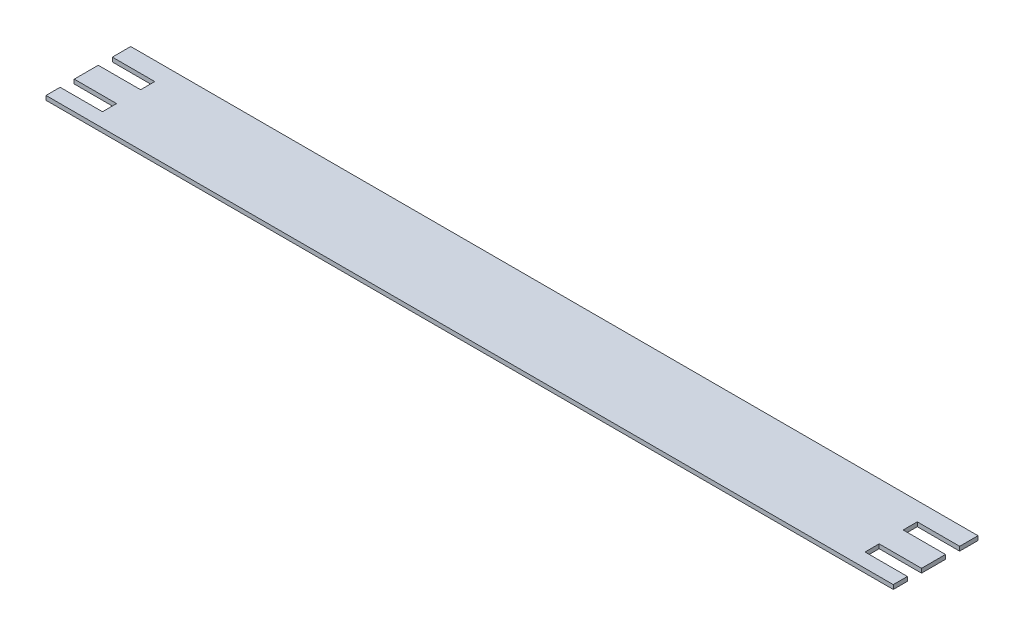
ISO-10303-21;
HEADER;
FILE_DESCRIPTION(('STEP AP214'),'2;1');
FILE_NAME('part.step','',(''),(''),'','','');
FILE_SCHEMA(('AUTOMOTIVE_DESIGN { 1 0 10303 214 1 1 1 1 }'));
ENDSEC;
DATA;
#1=APPLICATION_CONTEXT('core data for automotive mechanical design processes');
#2=APPLICATION_PROTOCOL_DEFINITION('international standard','automotive_design',2000,#1);
#3=PRODUCT_CONTEXT('',#1,'mechanical');
#4=PRODUCT('Part','Part','',(#3));
#5=PRODUCT_RELATED_PRODUCT_CATEGORY('part','',(#4));
#6=PRODUCT_DEFINITION_FORMATION('','',#4);
#7=PRODUCT_DEFINITION_CONTEXT('part definition',#1,'design');
#8=PRODUCT_DEFINITION('design','',#6,#7);
#9=PRODUCT_DEFINITION_SHAPE('','',#8);
#10=(LENGTH_UNIT() NAMED_UNIT(*) SI_UNIT(.MILLI.,.METRE.));
#11=(NAMED_UNIT(*) PLANE_ANGLE_UNIT() SI_UNIT($,.RADIAN.));
#12=(NAMED_UNIT(*) SI_UNIT($,.STERADIAN.) SOLID_ANGLE_UNIT());
#13=UNCERTAINTY_MEASURE_WITH_UNIT(LENGTH_MEASURE(1.E-05),#10,'distance_accuracy_value','');
#14=(GEOMETRIC_REPRESENTATION_CONTEXT(3) GLOBAL_UNCERTAINTY_ASSIGNED_CONTEXT((#13)) GLOBAL_UNIT_ASSIGNED_CONTEXT((#10,
#11,#12)) REPRESENTATION_CONTEXT('',''));
#15=CARTESIAN_POINT('',(0.,0.,0.));
#16=DIRECTION('',(0.,0.,1.));
#17=DIRECTION('',(1.,0.,0.));
#18=AXIS2_PLACEMENT_3D('',#15,#16,#17);
#19=CARTESIAN_POINT('',(300.,-50.01,13.));
#20=DIRECTION('',(0.,0.,-1.));
#21=DIRECTION('',(-1.,0.,0.));
#22=AXIS2_PLACEMENT_3D('',#19,#20,#21);
#23=PLANE('',#22);
#24=DIRECTION('',(0.,-1.,0.));
#25=VECTOR('',#24,1.);
#26=CARTESIAN_POINT('',(300.,1.71683972880179E-13,13.));
#27=LINE('',#26,#25);
#28=CARTESIAN_POINT('',(300.,-47.,13.));
#29=VERTEX_POINT('',#28);
#30=CARTESIAN_POINT('',(300.,-50.,13.));
#31=VERTEX_POINT('',#30);
#32=EDGE_CURVE('E228',#29,#31,#27,.T.);
#33=ORIENTED_EDGE('',*,*,#32,.F.);
#34=DIRECTION('',(1.,0.,0.));
#35=VECTOR('',#34,1.);
#36=CARTESIAN_POINT('',(-300.,-47.,13.));
#37=LINE('',#36,#35);
#38=CARTESIAN_POINT('',(270.,-47.,13.));
#39=VERTEX_POINT('',#38);
#40=EDGE_CURVE('E237',#39,#29,#37,.T.);
#41=ORIENTED_EDGE('',*,*,#40,.F.);
#42=DIRECTION('',(0.,1.,0.));
#43=VECTOR('',#42,1.);
#44=CARTESIAN_POINT('',(270.,-50.01,13.));
#45=LINE('',#44,#43);
#46=CARTESIAN_POINT('',(270.,-50.,13.));
#47=VERTEX_POINT('',#46);
#48=EDGE_CURVE('E300',#47,#39,#45,.T.);
#49=ORIENTED_EDGE('',*,*,#48,.F.);
#50=DIRECTION('',(-1.,0.,0.));
#51=VECTOR('',#50,1.);
#52=CARTESIAN_POINT('',(-300.,-50.,13.));
#53=LINE('',#52,#51);
#54=EDGE_CURVE('E265',#31,#47,#53,.T.);
#55=ORIENTED_EDGE('',*,*,#54,.F.);
#56=EDGE_LOOP('',(#33,#41,#49,#55));
#57=FACE_BOUND('',#56,.T.);
#58=ADVANCED_FACE('F32',(#57),#23,.F.);
#59=CARTESIAN_POINT('',(300.,-50.01,23.));
#60=DIRECTION('',(0.,0.,1.));
#61=DIRECTION('',(1.,0.,0.));
#62=AXIS2_PLACEMENT_3D('',#59,#60,#61);
#63=PLANE('',#62);
#64=DIRECTION('',(0.,1.,0.));
#65=VECTOR('',#64,1.);
#66=CARTESIAN_POINT('',(270.,-50.01,23.));
#67=LINE('',#66,#65);
#68=CARTESIAN_POINT('',(270.,-50.,23.));
#69=VERTEX_POINT('',#68);
#70=CARTESIAN_POINT('',(270.,-47.,23.));
#71=VERTEX_POINT('',#70);
#72=EDGE_CURVE('E36',#69,#71,#67,.T.);
#73=ORIENTED_EDGE('',*,*,#72,.T.);
#74=DIRECTION('',(-1.,0.,0.));
#75=VECTOR('',#74,1.);
#76=CARTESIAN_POINT('',(-300.,-47.,23.));
#77=LINE('',#76,#75);
#78=CARTESIAN_POINT('',(300.,-47.,23.));
#79=VERTEX_POINT('',#78);
#80=EDGE_CURVE('E277',#79,#71,#77,.T.);
#81=ORIENTED_EDGE('',*,*,#80,.F.);
#82=DIRECTION('',(0.,1.,0.));
#83=VECTOR('',#82,1.);
#84=CARTESIAN_POINT('',(300.,1.71683972880179E-13,23.));
#85=LINE('',#84,#83);
#86=CARTESIAN_POINT('',(300.,-50.,23.));
#87=VERTEX_POINT('',#86);
#88=EDGE_CURVE('E225',#87,#79,#85,.T.);
#89=ORIENTED_EDGE('',*,*,#88,.F.);
#90=DIRECTION('',(1.,0.,0.));
#91=VECTOR('',#90,1.);
#92=CARTESIAN_POINT('',(-300.,-50.,23.));
#93=LINE('',#92,#91);
#94=EDGE_CURVE('E269',#69,#87,#93,.T.);
#95=ORIENTED_EDGE('',*,*,#94,.F.);
#96=EDGE_LOOP('',(#73,#81,#89,#95));
#97=FACE_BOUND('',#96,.T.);
#98=ADVANCED_FACE('F313',(#97),#63,.F.);
#99=CARTESIAN_POINT('',(270.,-50.01,13.));
#100=DIRECTION('',(-1.,0.,0.));
#101=DIRECTION('',(0.,0.,1.));
#102=AXIS2_PLACEMENT_3D('',#99,#100,#101);
#103=PLANE('',#102);
#104=ORIENTED_EDGE('',*,*,#48,.T.);
#105=DIRECTION('',(0.,0.,-1.));
#106=VECTOR('',#105,1.);
#107=CARTESIAN_POINT('',(270.,-47.,3.));
#108=LINE('',#107,#106);
#109=EDGE_CURVE('E317',#71,#39,#108,.T.);
#110=ORIENTED_EDGE('',*,*,#109,.F.);
#111=ORIENTED_EDGE('',*,*,#72,.F.);
#112=DIRECTION('',(0.,0.,1.));
#113=VECTOR('',#112,1.);
#114=CARTESIAN_POINT('',(270.,-50.,60.));
#115=LINE('',#114,#113);
#116=EDGE_CURVE('E342',#47,#69,#115,.T.);
#117=ORIENTED_EDGE('',*,*,#116,.F.);
#118=EDGE_LOOP('',(#104,#110,#111,#117));
#119=FACE_BOUND('',#118,.T.);
#120=ADVANCED_FACE('F318',(#119),#103,.F.);
#121=CARTESIAN_POINT('',(300.,-50.01,40.));
#122=DIRECTION('',(0.,0.,-1.));
#123=DIRECTION('',(-1.,0.,0.));
#124=AXIS2_PLACEMENT_3D('',#121,#122,#123);
#125=PLANE('',#124);
#126=DIRECTION('',(0.,-1.,0.));
#127=VECTOR('',#126,1.);
#128=CARTESIAN_POINT('',(300.,1.71683972880179E-13,40.));
#129=LINE('',#128,#127);
#130=CARTESIAN_POINT('',(300.,-47.,40.));
#131=VERTEX_POINT('',#130);
#132=CARTESIAN_POINT('',(300.,-50.,40.));
#133=VERTEX_POINT('',#132);
#134=EDGE_CURVE('E222',#131,#133,#129,.T.);
#135=ORIENTED_EDGE('',*,*,#134,.F.);
#136=DIRECTION('',(1.,0.,0.));
#137=VECTOR('',#136,1.);
#138=CARTESIAN_POINT('',(-300.,-47.,40.));
#139=LINE('',#138,#137);
#140=CARTESIAN_POINT('',(270.,-47.,40.));
#141=VERTEX_POINT('',#140);
#142=EDGE_CURVE('E232',#141,#131,#139,.T.);
#143=ORIENTED_EDGE('',*,*,#142,.F.);
#144=DIRECTION('',(0.,1.,0.));
#145=VECTOR('',#144,1.);
#146=CARTESIAN_POINT('',(270.,-50.01,40.));
#147=LINE('',#146,#145);
#148=CARTESIAN_POINT('',(270.,-50.,40.));
#149=VERTEX_POINT('',#148);
#150=EDGE_CURVE('E251',#149,#141,#147,.T.);
#151=ORIENTED_EDGE('',*,*,#150,.F.);
#152=DIRECTION('',(-1.,0.,0.));
#153=VECTOR('',#152,1.);
#154=CARTESIAN_POINT('',(-300.,-50.,40.));
#155=LINE('',#154,#153);
#156=EDGE_CURVE('E241',#133,#149,#155,.T.);
#157=ORIENTED_EDGE('',*,*,#156,.F.);
#158=EDGE_LOOP('',(#135,#143,#151,#157));
#159=FACE_BOUND('',#158,.T.);
#160=ADVANCED_FACE('F374',(#159),#125,.F.);
#161=CARTESIAN_POINT('',(300.,-50.01,50.));
#162=DIRECTION('',(0.,0.,1.));
#163=DIRECTION('',(1.,0.,0.));
#164=AXIS2_PLACEMENT_3D('',#161,#162,#163);
#165=PLANE('',#164);
#166=DIRECTION('',(0.,1.,0.));
#167=VECTOR('',#166,1.);
#168=CARTESIAN_POINT('',(270.,-50.01,50.));
#169=LINE('',#168,#167);
#170=CARTESIAN_POINT('',(270.,-50.,50.));
#171=VERTEX_POINT('',#170);
#172=CARTESIAN_POINT('',(270.,-47.,50.));
#173=VERTEX_POINT('',#172);
#174=EDGE_CURVE('E255',#171,#173,#169,.T.);
#175=ORIENTED_EDGE('',*,*,#174,.T.);
#176=DIRECTION('',(-1.,0.,0.));
#177=VECTOR('',#176,1.);
#178=CARTESIAN_POINT('',(-300.,-47.,50.));
#179=LINE('',#178,#177);
#180=CARTESIAN_POINT('',(300.,-47.,50.));
#181=VERTEX_POINT('',#180);
#182=EDGE_CURVE('E226',#181,#173,#179,.T.);
#183=ORIENTED_EDGE('',*,*,#182,.F.);
#184=DIRECTION('',(0.,1.,0.));
#185=VECTOR('',#184,1.);
#186=CARTESIAN_POINT('',(300.,1.71683972880179E-13,50.));
#187=LINE('',#186,#185);
#188=CARTESIAN_POINT('',(300.,-50.,50.));
#189=VERTEX_POINT('',#188);
#190=EDGE_CURVE('E220',#189,#181,#187,.T.);
#191=ORIENTED_EDGE('',*,*,#190,.F.);
#192=DIRECTION('',(1.,0.,0.));
#193=VECTOR('',#192,1.);
#194=CARTESIAN_POINT('',(-300.,-50.,50.));
#195=LINE('',#194,#193);
#196=EDGE_CURVE('E235',#171,#189,#195,.T.);
#197=ORIENTED_EDGE('',*,*,#196,.F.);
#198=EDGE_LOOP('',(#175,#183,#191,#197));
#199=FACE_BOUND('',#198,.T.);
#200=ADVANCED_FACE('F378',(#199),#165,.F.);
#201=CARTESIAN_POINT('',(270.,-50.01,40.));
#202=DIRECTION('',(-1.,0.,0.));
#203=DIRECTION('',(0.,0.,1.));
#204=AXIS2_PLACEMENT_3D('',#201,#202,#203);
#205=PLANE('',#204);
#206=ORIENTED_EDGE('',*,*,#150,.T.);
#207=DIRECTION('',(0.,0.,-1.));
#208=VECTOR('',#207,1.);
#209=CARTESIAN_POINT('',(270.,-47.,3.));
#210=LINE('',#209,#208);
#211=EDGE_CURVE('E229',#173,#141,#210,.T.);
#212=ORIENTED_EDGE('',*,*,#211,.F.);
#213=ORIENTED_EDGE('',*,*,#174,.F.);
#214=DIRECTION('',(0.,0.,1.));
#215=VECTOR('',#214,1.);
#216=CARTESIAN_POINT('',(270.,-50.,60.));
#217=LINE('',#216,#215);
#218=EDGE_CURVE('E238',#149,#171,#217,.T.);
#219=ORIENTED_EDGE('',*,*,#218,.F.);
#220=EDGE_LOOP('',(#206,#212,#213,#219));
#221=FACE_BOUND('',#220,.T.);
#222=ADVANCED_FACE('F384',(#221),#205,.F.);
#223=CARTESIAN_POINT('',(-300.,-50.01,23.));
#224=DIRECTION('',(0.,0.,1.));
#225=DIRECTION('',(1.,0.,0.));
#226=AXIS2_PLACEMENT_3D('',#223,#224,#225);
#227=PLANE('',#226);
#228=DIRECTION('',(0.,1.,0.));
#229=VECTOR('',#228,1.);
#230=CARTESIAN_POINT('',(-300.,0.,23.));
#231=LINE('',#230,#229);
#232=CARTESIAN_POINT('',(-300.,-50.,23.));
#233=VERTEX_POINT('',#232);
#234=CARTESIAN_POINT('',(-300.,-47.,23.));
#235=VERTEX_POINT('',#234);
#236=EDGE_CURVE('E181',#233,#235,#231,.T.);
#237=ORIENTED_EDGE('',*,*,#236,.T.);
#238=DIRECTION('',(-1.,0.,0.));
#239=VECTOR('',#238,1.);
#240=CARTESIAN_POINT('',(-300.,-47.,23.));
#241=LINE('',#240,#239);
#242=CARTESIAN_POINT('',(-270.,-47.,23.));
#243=VERTEX_POINT('',#242);
#244=EDGE_CURVE('E275',#243,#235,#241,.T.);
#245=ORIENTED_EDGE('',*,*,#244,.F.);
#246=DIRECTION('',(0.,1.,0.));
#247=VECTOR('',#246,1.);
#248=CARTESIAN_POINT('',(-270.,-50.01,23.));
#249=LINE('',#248,#247);
#250=CARTESIAN_POINT('',(-270.,-50.,23.));
#251=VERTEX_POINT('',#250);
#252=EDGE_CURVE('E259',#251,#243,#249,.T.);
#253=ORIENTED_EDGE('',*,*,#252,.F.);
#254=DIRECTION('',(1.,0.,0.));
#255=VECTOR('',#254,1.);
#256=CARTESIAN_POINT('',(-300.,-50.,23.));
#257=LINE('',#256,#255);
#258=EDGE_CURVE('E266',#233,#251,#257,.T.);
#259=ORIENTED_EDGE('',*,*,#258,.F.);
#260=EDGE_LOOP('',(#237,#245,#253,#259));
#261=FACE_BOUND('',#260,.T.);
#262=ADVANCED_FACE('F390',(#261),#227,.F.);
#263=CARTESIAN_POINT('',(-300.,-50.01,13.));
#264=DIRECTION('',(0.,0.,-1.));
#265=DIRECTION('',(-1.,0.,0.));
#266=AXIS2_PLACEMENT_3D('',#263,#264,#265);
#267=PLANE('',#266);
#268=DIRECTION('',(0.,1.,0.));
#269=VECTOR('',#268,1.);
#270=CARTESIAN_POINT('',(-270.,-50.01,13.));
#271=LINE('',#270,#269);
#272=CARTESIAN_POINT('',(-270.,-50.,13.));
#273=VERTEX_POINT('',#272);
#274=CARTESIAN_POINT('',(-270.,-47.,13.));
#275=VERTEX_POINT('',#274);
#276=EDGE_CURVE('E188',#273,#275,#271,.T.);
#277=ORIENTED_EDGE('',*,*,#276,.T.);
#278=DIRECTION('',(1.,0.,0.));
#279=VECTOR('',#278,1.);
#280=CARTESIAN_POINT('',(-300.,-47.,13.));
#281=LINE('',#280,#279);
#282=CARTESIAN_POINT('',(-300.,-47.,13.));
#283=VERTEX_POINT('',#282);
#284=EDGE_CURVE('E185',#283,#275,#281,.T.);
#285=ORIENTED_EDGE('',*,*,#284,.F.);
#286=DIRECTION('',(0.,-1.,0.));
#287=VECTOR('',#286,1.);
#288=CARTESIAN_POINT('',(-300.,0.,13.));
#289=LINE('',#288,#287);
#290=CARTESIAN_POINT('',(-300.,-50.,13.));
#291=VERTEX_POINT('',#290);
#292=EDGE_CURVE('E173',#283,#291,#289,.T.);
#293=ORIENTED_EDGE('',*,*,#292,.T.);
#294=DIRECTION('',(-1.,0.,0.));
#295=VECTOR('',#294,1.);
#296=CARTESIAN_POINT('',(-300.,-50.,13.));
#297=LINE('',#296,#295);
#298=EDGE_CURVE('E272',#273,#291,#297,.T.);
#299=ORIENTED_EDGE('',*,*,#298,.F.);
#300=EDGE_LOOP('',(#277,#285,#293,#299));
#301=FACE_BOUND('',#300,.T.);
#302=ADVANCED_FACE('F186',(#301),#267,.F.);
#303=CARTESIAN_POINT('',(-270.,-50.01,13.));
#304=DIRECTION('',(1.,0.,0.));
#305=DIRECTION('',(0.,0.,-1.));
#306=AXIS2_PLACEMENT_3D('',#303,#304,#305);
#307=PLANE('',#306);
#308=ORIENTED_EDGE('',*,*,#252,.T.);
#309=DIRECTION('',(0.,0.,1.));
#310=VECTOR('',#309,1.);
#311=CARTESIAN_POINT('',(-270.,-47.,3.));
#312=LINE('',#311,#310);
#313=EDGE_CURVE('E192',#275,#243,#312,.T.);
#314=ORIENTED_EDGE('',*,*,#313,.F.);
#315=ORIENTED_EDGE('',*,*,#276,.F.);
#316=DIRECTION('',(0.,0.,-1.));
#317=VECTOR('',#316,1.);
#318=CARTESIAN_POINT('',(-270.,-50.,60.));
#319=LINE('',#318,#317);
#320=EDGE_CURVE('E268',#251,#273,#319,.T.);
#321=ORIENTED_EDGE('',*,*,#320,.F.);
#322=EDGE_LOOP('',(#308,#314,#315,#321));
#323=FACE_BOUND('',#322,.T.);
#324=ADVANCED_FACE('F400',(#323),#307,.F.);
#325=CARTESIAN_POINT('',(-300.,-50.01,50.));
#326=DIRECTION('',(0.,0.,1.));
#327=DIRECTION('',(1.,0.,0.));
#328=AXIS2_PLACEMENT_3D('',#325,#326,#327);
#329=PLANE('',#328);
#330=DIRECTION('',(0.,1.,0.));
#331=VECTOR('',#330,1.);
#332=CARTESIAN_POINT('',(-300.,0.,50.));
#333=LINE('',#332,#331);
#334=CARTESIAN_POINT('',(-300.,-50.,50.));
#335=VERTEX_POINT('',#334);
#336=CARTESIAN_POINT('',(-300.,-47.,50.));
#337=VERTEX_POINT('',#336);
#338=EDGE_CURVE('E182',#335,#337,#333,.T.);
#339=ORIENTED_EDGE('',*,*,#338,.T.);
#340=DIRECTION('',(-1.,0.,0.));
#341=VECTOR('',#340,1.);
#342=CARTESIAN_POINT('',(-300.,-47.,50.));
#343=LINE('',#342,#341);
#344=CARTESIAN_POINT('',(-270.,-47.,50.));
#345=VERTEX_POINT('',#344);
#346=EDGE_CURVE('E191',#345,#337,#343,.T.);
#347=ORIENTED_EDGE('',*,*,#346,.F.);
#348=DIRECTION('',(0.,1.,0.));
#349=VECTOR('',#348,1.);
#350=CARTESIAN_POINT('',(-270.,-50.01,50.));
#351=LINE('',#350,#349);
#352=CARTESIAN_POINT('',(-270.,-50.,50.));
#353=VERTEX_POINT('',#352);
#354=EDGE_CURVE('E260',#353,#345,#351,.T.);
#355=ORIENTED_EDGE('',*,*,#354,.F.);
#356=DIRECTION('',(1.,0.,0.));
#357=VECTOR('',#356,1.);
#358=CARTESIAN_POINT('',(-300.,-50.,50.));
#359=LINE('',#358,#357);
#360=EDGE_CURVE('E274',#335,#353,#359,.T.);
#361=ORIENTED_EDGE('',*,*,#360,.F.);
#362=EDGE_LOOP('',(#339,#347,#355,#361));
#363=FACE_BOUND('',#362,.T.);
#364=ADVANCED_FACE('F293',(#363),#329,.F.);
#365=CARTESIAN_POINT('',(-300.,-50.01,40.));
#366=DIRECTION('',(0.,0.,-1.));
#367=DIRECTION('',(-1.,0.,0.));
#368=AXIS2_PLACEMENT_3D('',#365,#366,#367);
#369=PLANE('',#368);
#370=DIRECTION('',(0.,1.,0.));
#371=VECTOR('',#370,1.);
#372=CARTESIAN_POINT('',(-270.,-50.01,40.));
#373=LINE('',#372,#371);
#374=CARTESIAN_POINT('',(-270.,-50.,40.));
#375=VERTEX_POINT('',#374);
#376=CARTESIAN_POINT('',(-270.,-47.,40.));
#377=VERTEX_POINT('',#376);
#378=EDGE_CURVE('E254',#375,#377,#373,.T.);
#379=ORIENTED_EDGE('',*,*,#378,.T.);
#380=DIRECTION('',(1.,0.,0.));
#381=VECTOR('',#380,1.);
#382=CARTESIAN_POINT('',(-300.,-47.,40.));
#383=LINE('',#382,#381);
#384=CARTESIAN_POINT('',(-300.,-47.,40.));
#385=VERTEX_POINT('',#384);
#386=EDGE_CURVE('E234',#385,#377,#383,.T.);
#387=ORIENTED_EDGE('',*,*,#386,.F.);
#388=DIRECTION('',(0.,-1.,0.));
#389=VECTOR('',#388,1.);
#390=CARTESIAN_POINT('',(-300.,0.,40.));
#391=LINE('',#390,#389);
#392=CARTESIAN_POINT('',(-300.,-50.,40.));
#393=VERTEX_POINT('',#392);
#394=EDGE_CURVE('E302',#385,#393,#391,.T.);
#395=ORIENTED_EDGE('',*,*,#394,.T.);
#396=DIRECTION('',(-1.,0.,0.));
#397=VECTOR('',#396,1.);
#398=CARTESIAN_POINT('',(-300.,-50.,40.));
#399=LINE('',#398,#397);
#400=EDGE_CURVE('E243',#375,#393,#399,.T.);
#401=ORIENTED_EDGE('',*,*,#400,.F.);
#402=EDGE_LOOP('',(#379,#387,#395,#401));
#403=FACE_BOUND('',#402,.T.);
#404=ADVANCED_FACE('F406',(#403),#369,.F.);
#405=CARTESIAN_POINT('',(-270.,-50.01,40.));
#406=DIRECTION('',(1.,0.,0.));
#407=DIRECTION('',(0.,0.,-1.));
#408=AXIS2_PLACEMENT_3D('',#405,#406,#407);
#409=PLANE('',#408);
#410=ORIENTED_EDGE('',*,*,#354,.T.);
#411=DIRECTION('',(0.,0.,1.));
#412=VECTOR('',#411,1.);
#413=CARTESIAN_POINT('',(-270.,-47.,3.));
#414=LINE('',#413,#412);
#415=EDGE_CURVE('E288',#377,#345,#414,.T.);
#416=ORIENTED_EDGE('',*,*,#415,.F.);
#417=ORIENTED_EDGE('',*,*,#378,.F.);
#418=DIRECTION('',(0.,0.,-1.));
#419=VECTOR('',#418,1.);
#420=CARTESIAN_POINT('',(-270.,-50.,60.));
#421=LINE('',#420,#419);
#422=EDGE_CURVE('E290',#353,#375,#421,.T.);
#423=ORIENTED_EDGE('',*,*,#422,.F.);
#424=EDGE_LOOP('',(#410,#416,#417,#423));
#425=FACE_BOUND('',#424,.T.);
#426=ADVANCED_FACE('F285',(#425),#409,.F.);
#427=CARTESIAN_POINT('',(-300.,0.,0.));
#428=DIRECTION('',(0.,0.,1.));
#429=DIRECTION('',(1.,0.,0.));
#430=AXIS2_PLACEMENT_3D('',#427,#428,#429);
#431=PLANE('',#430);
#432=DIRECTION('',(0.,-1.,0.));
#433=VECTOR('',#432,1.);
#434=CARTESIAN_POINT('',(-300.,0.,0.));
#435=LINE('',#434,#433);
#436=CARTESIAN_POINT('',(-300.,-47.,0.));
#437=VERTEX_POINT('',#436);
#438=CARTESIAN_POINT('',(-300.,-50.,0.));
#439=VERTEX_POINT('',#438);
#440=EDGE_CURVE('E11',#437,#439,#435,.T.);
#441=ORIENTED_EDGE('',*,*,#440,.F.);
#442=DIRECTION('',(-1.,0.,0.));
#443=VECTOR('',#442,1.);
#444=CARTESIAN_POINT('',(-300.,-47.,0.));
#445=LINE('',#444,#443);
#446=CARTESIAN_POINT('',(300.,-47.,0.));
#447=VERTEX_POINT('',#446);
#448=EDGE_CURVE('E196',#447,#437,#445,.T.);
#449=ORIENTED_EDGE('',*,*,#448,.F.);
#450=DIRECTION('',(0.,-1.,0.));
#451=VECTOR('',#450,1.);
#452=CARTESIAN_POINT('',(300.,3.43367945760358E-13,0.));
#453=LINE('',#452,#451);
#454=CARTESIAN_POINT('',(300.,-50.,0.));
#455=VERTEX_POINT('',#454);
#456=EDGE_CURVE('E41',#447,#455,#453,.T.);
#457=ORIENTED_EDGE('',*,*,#456,.T.);
#458=DIRECTION('',(1.,0.,0.));
#459=VECTOR('',#458,1.);
#460=CARTESIAN_POINT('',(-300.,-50.,0.));
#461=LINE('',#460,#459);
#462=EDGE_CURVE('E210',#439,#455,#461,.T.);
#463=ORIENTED_EDGE('',*,*,#462,.F.);
#464=EDGE_LOOP('',(#441,#449,#457,#463));
#465=FACE_BOUND('',#464,.T.);
#466=ADVANCED_FACE('F350',(#465),#431,.F.);
#467=CARTESIAN_POINT('',(-300.,0.,60.));
#468=DIRECTION('',(0.,0.,1.));
#469=DIRECTION('',(1.,0.,0.));
#470=AXIS2_PLACEMENT_3D('',#467,#468,#469);
#471=PLANE('',#470);
#472=DIRECTION('',(1.,0.,0.));
#473=VECTOR('',#472,1.);
#474=CARTESIAN_POINT('',(-300.,-47.,60.));
#475=LINE('',#474,#473);
#476=CARTESIAN_POINT('',(-300.,-47.,60.));
#477=VERTEX_POINT('',#476);
#478=CARTESIAN_POINT('',(300.,-47.,60.));
#479=VERTEX_POINT('',#478);
#480=EDGE_CURVE('E206',#477,#479,#475,.T.);
#481=ORIENTED_EDGE('',*,*,#480,.F.);
#482=DIRECTION('',(0.,-1.,0.));
#483=VECTOR('',#482,1.);
#484=CARTESIAN_POINT('',(-300.,0.,60.));
#485=LINE('',#484,#483);
#486=CARTESIAN_POINT('',(-300.,-50.,60.));
#487=VERTEX_POINT('',#486);
#488=EDGE_CURVE('E326',#477,#487,#485,.T.);
#489=ORIENTED_EDGE('',*,*,#488,.T.);
#490=DIRECTION('',(1.,0.,0.));
#491=VECTOR('',#490,1.);
#492=CARTESIAN_POINT('',(-300.,-50.,60.));
#493=LINE('',#492,#491);
#494=CARTESIAN_POINT('',(300.,-50.,60.));
#495=VERTEX_POINT('',#494);
#496=EDGE_CURVE('E198',#487,#495,#493,.T.);
#497=ORIENTED_EDGE('',*,*,#496,.T.);
#498=DIRECTION('',(0.,-1.,0.));
#499=VECTOR('',#498,1.);
#500=CARTESIAN_POINT('',(300.,3.43367945760358E-13,60.));
#501=LINE('',#500,#499);
#502=EDGE_CURVE('E329',#479,#495,#501,.T.);
#503=ORIENTED_EDGE('',*,*,#502,.F.);
#504=EDGE_LOOP('',(#481,#489,#497,#503));
#505=FACE_BOUND('',#504,.T.);
#506=ADVANCED_FACE('F358',(#505),#471,.T.);
#507=CARTESIAN_POINT('',(-300.,-47.,3.));
#508=DIRECTION('',(0.,-1.,0.));
#509=DIRECTION('',(0.,0.,-1.));
#510=AXIS2_PLACEMENT_3D('',#507,#508,#509);
#511=PLANE('',#510);
#512=ORIENTED_EDGE('',*,*,#109,.T.);
#513=ORIENTED_EDGE('',*,*,#40,.T.);
#514=DIRECTION('',(0.,0.,1.));
#515=VECTOR('',#514,1.);
#516=CARTESIAN_POINT('',(300.,-47.,3.));
#517=LINE('',#516,#515);
#518=EDGE_CURVE('E57',#447,#29,#517,.T.);
#519=ORIENTED_EDGE('',*,*,#518,.F.);
#520=ORIENTED_EDGE('',*,*,#448,.T.);
#521=DIRECTION('',(0.,0.,1.));
#522=VECTOR('',#521,1.);
#523=CARTESIAN_POINT('',(-300.,-47.,3.));
#524=LINE('',#523,#522);
#525=EDGE_CURVE('E177',#437,#283,#524,.T.);
#526=ORIENTED_EDGE('',*,*,#525,.T.);
#527=ORIENTED_EDGE('',*,*,#284,.T.);
#528=ORIENTED_EDGE('',*,*,#313,.T.);
#529=ORIENTED_EDGE('',*,*,#244,.T.);
#530=EDGE_CURVE('E197',#235,#385,#524,.T.);
#531=ORIENTED_EDGE('',*,*,#530,.T.);
#532=ORIENTED_EDGE('',*,*,#386,.T.);
#533=ORIENTED_EDGE('',*,*,#415,.T.);
#534=ORIENTED_EDGE('',*,*,#346,.T.);
#535=EDGE_CURVE('E200',#337,#477,#524,.T.);
#536=ORIENTED_EDGE('',*,*,#535,.T.);
#537=ORIENTED_EDGE('',*,*,#480,.T.);
#538=EDGE_CURVE('E246',#181,#479,#517,.T.);
#539=ORIENTED_EDGE('',*,*,#538,.F.);
#540=ORIENTED_EDGE('',*,*,#182,.T.);
#541=ORIENTED_EDGE('',*,*,#211,.T.);
#542=ORIENTED_EDGE('',*,*,#142,.T.);
#543=EDGE_CURVE('E245',#79,#131,#517,.T.);
#544=ORIENTED_EDGE('',*,*,#543,.F.);
#545=ORIENTED_EDGE('',*,*,#80,.T.);
#546=EDGE_LOOP('',(#512,#513,#519,#520,#526,#527,#528,#529,#531,#532,#533,#534,#536,#537,#539,
#540,#541,#542,#544,#545));
#547=FACE_BOUND('',#546,.T.);
#548=ADVANCED_FACE('F34',(#547),#511,.F.);
#549=CARTESIAN_POINT('',(-300.,-50.,60.));
#550=DIRECTION('',(0.,1.,0.));
#551=DIRECTION('',(0.,0.,1.));
#552=AXIS2_PLACEMENT_3D('',#549,#550,#551);
#553=PLANE('',#552);
#554=DIRECTION('',(0.,0.,-1.));
#555=VECTOR('',#554,1.);
#556=CARTESIAN_POINT('',(300.,-50.,60.));
#557=LINE('',#556,#555);
#558=EDGE_CURVE('E49',#31,#455,#557,.T.);
#559=ORIENTED_EDGE('',*,*,#558,.F.);
#560=ORIENTED_EDGE('',*,*,#54,.T.);
#561=ORIENTED_EDGE('',*,*,#116,.T.);
#562=ORIENTED_EDGE('',*,*,#94,.T.);
#563=EDGE_CURVE('E250',#133,#87,#557,.T.);
#564=ORIENTED_EDGE('',*,*,#563,.F.);
#565=ORIENTED_EDGE('',*,*,#156,.T.);
#566=ORIENTED_EDGE('',*,*,#218,.T.);
#567=ORIENTED_EDGE('',*,*,#196,.T.);
#568=EDGE_CURVE('E247',#495,#189,#557,.T.);
#569=ORIENTED_EDGE('',*,*,#568,.F.);
#570=ORIENTED_EDGE('',*,*,#496,.F.);
#571=DIRECTION('',(0.,0.,-1.));
#572=VECTOR('',#571,1.);
#573=CARTESIAN_POINT('',(-300.,-50.,60.));
#574=LINE('',#573,#572);
#575=EDGE_CURVE('E328',#487,#335,#574,.T.);
#576=ORIENTED_EDGE('',*,*,#575,.T.);
#577=ORIENTED_EDGE('',*,*,#360,.T.);
#578=ORIENTED_EDGE('',*,*,#422,.T.);
#579=ORIENTED_EDGE('',*,*,#400,.T.);
#580=EDGE_CURVE('E351',#393,#233,#574,.T.);
#581=ORIENTED_EDGE('',*,*,#580,.T.);
#582=ORIENTED_EDGE('',*,*,#258,.T.);
#583=ORIENTED_EDGE('',*,*,#320,.T.);
#584=ORIENTED_EDGE('',*,*,#298,.T.);
#585=EDGE_CURVE('E179',#291,#439,#574,.T.);
#586=ORIENTED_EDGE('',*,*,#585,.T.);
#587=ORIENTED_EDGE('',*,*,#462,.T.);
#588=EDGE_LOOP('',(#559,#560,#561,#562,#564,#565,#566,#567,#569,#570,#576,#577,#578,#579,#581,
#582,#583,#584,#586,#587));
#589=FACE_BOUND('',#588,.T.);
#590=ADVANCED_FACE('F340',(#589),#553,.F.);
#591=CARTESIAN_POINT('',(-300.,0.,0.));
#592=DIRECTION('',(-1.,0.,0.));
#593=DIRECTION('',(0.,0.,1.));
#594=AXIS2_PLACEMENT_3D('',#591,#592,#593);
#595=PLANE('',#594);
#596=ORIENTED_EDGE('',*,*,#236,.F.);
#597=ORIENTED_EDGE('',*,*,#580,.F.);
#598=ORIENTED_EDGE('',*,*,#394,.F.);
#599=ORIENTED_EDGE('',*,*,#530,.F.);
#600=EDGE_LOOP('',(#596,#597,#598,#599));
#601=FACE_BOUND('',#600,.T.);
#602=ADVANCED_FACE('F413',(#601),#595,.T.);
#603=ORIENTED_EDGE('',*,*,#338,.F.);
#604=ORIENTED_EDGE('',*,*,#575,.F.);
#605=ORIENTED_EDGE('',*,*,#488,.F.);
#606=ORIENTED_EDGE('',*,*,#535,.F.);
#607=EDGE_LOOP('',(#603,#604,#605,#606));
#608=FACE_BOUND('',#607,.T.);
#609=ADVANCED_FACE('F356',(#608),#595,.T.);
#610=ORIENTED_EDGE('',*,*,#292,.F.);
#611=ORIENTED_EDGE('',*,*,#525,.F.);
#612=ORIENTED_EDGE('',*,*,#440,.T.);
#613=ORIENTED_EDGE('',*,*,#585,.F.);
#614=EDGE_LOOP('',(#610,#611,#612,#613));
#615=FACE_BOUND('',#614,.T.);
#616=ADVANCED_FACE('F175',(#615),#595,.T.);
#617=CARTESIAN_POINT('',(300.,1.71683972880179E-13,0.));
#618=DIRECTION('',(-1.,0.,0.));
#619=DIRECTION('',(0.,-1.,0.));
#620=AXIS2_PLACEMENT_3D('',#617,#618,#619);
#621=PLANE('',#620);
#622=ORIENTED_EDGE('',*,*,#568,.T.);
#623=ORIENTED_EDGE('',*,*,#190,.T.);
#624=ORIENTED_EDGE('',*,*,#538,.T.);
#625=ORIENTED_EDGE('',*,*,#502,.T.);
#626=EDGE_LOOP('',(#622,#623,#624,#625));
#627=FACE_BOUND('',#626,.T.);
#628=ADVANCED_FACE('F392',(#627),#621,.F.);
#629=ORIENTED_EDGE('',*,*,#563,.T.);
#630=ORIENTED_EDGE('',*,*,#88,.T.);
#631=ORIENTED_EDGE('',*,*,#543,.T.);
#632=ORIENTED_EDGE('',*,*,#134,.T.);
#633=EDGE_LOOP('',(#629,#630,#631,#632));
#634=FACE_BOUND('',#633,.T.);
#635=ADVANCED_FACE('F336',(#634),#621,.F.);
#636=ORIENTED_EDGE('',*,*,#518,.T.);
#637=ORIENTED_EDGE('',*,*,#32,.T.);
#638=ORIENTED_EDGE('',*,*,#558,.T.);
#639=ORIENTED_EDGE('',*,*,#456,.F.);
#640=EDGE_LOOP('',(#636,#637,#638,#639));
#641=FACE_BOUND('',#640,.T.);
#642=ADVANCED_FACE('F347',(#641),#621,.F.);
#643=CLOSED_SHELL('',(#58,#98,#120,#160,#200,#222,#262,#302,#324,#364,#404,#426,#466,#506,#548,
#590,#602,#609,#616,#628,#635,#642));
#644=MANIFOLD_SOLID_BREP('B2',#643);
#645=ADVANCED_BREP_SHAPE_REPRESENTATION('',(#18,#644),#14);
#646=SHAPE_DEFINITION_REPRESENTATION(#9,#645);
ENDSEC;
END-ISO-10303-21;
